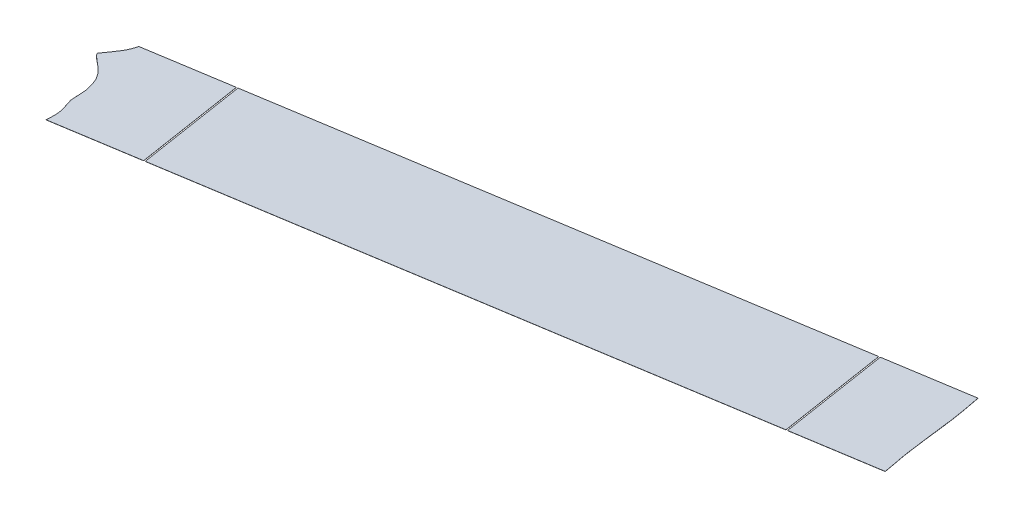
ISO-10303-21;
HEADER;
FILE_DESCRIPTION(('STEP AP214'),'2;1');
FILE_NAME('part.step','',(''),(''),'','','');
FILE_SCHEMA(('AUTOMOTIVE_DESIGN { 1 0 10303 214 1 1 1 1 }'));
ENDSEC;
DATA;
#1=APPLICATION_CONTEXT('core data for automotive mechanical design processes');
#2=APPLICATION_PROTOCOL_DEFINITION('international standard','automotive_design',2000,#1);
#3=PRODUCT_CONTEXT('',#1,'mechanical');
#4=PRODUCT('Part','Part','',(#3));
#5=PRODUCT_RELATED_PRODUCT_CATEGORY('part','',(#4));
#6=PRODUCT_DEFINITION_FORMATION('','',#4);
#7=PRODUCT_DEFINITION_CONTEXT('part definition',#1,'design');
#8=PRODUCT_DEFINITION('design','',#6,#7);
#9=PRODUCT_DEFINITION_SHAPE('','',#8);
#10=(LENGTH_UNIT() NAMED_UNIT(*) SI_UNIT(.MILLI.,.METRE.));
#11=(NAMED_UNIT(*) PLANE_ANGLE_UNIT() SI_UNIT($,.RADIAN.));
#12=(NAMED_UNIT(*) SI_UNIT($,.STERADIAN.) SOLID_ANGLE_UNIT());
#13=UNCERTAINTY_MEASURE_WITH_UNIT(LENGTH_MEASURE(1.E-05),#10,'distance_accuracy_value','');
#14=(GEOMETRIC_REPRESENTATION_CONTEXT(3) GLOBAL_UNCERTAINTY_ASSIGNED_CONTEXT((#13)) GLOBAL_UNIT_ASSIGNED_CONTEXT((#10,
#11,#12)) REPRESENTATION_CONTEXT('',''));
#15=CARTESIAN_POINT('',(0.,0.,0.));
#16=DIRECTION('',(0.,0.,1.));
#17=DIRECTION('',(1.,0.,0.));
#18=AXIS2_PLACEMENT_3D('',#15,#16,#17);
#19=CARTESIAN_POINT('',(2071.33887699728,381.384892477977,167.6098036128));
#20=DIRECTION('',(0.156902088768091,0.00396825396825129,0.987606190493282));
#21=DIRECTION('',(0.987613966521994,0.,-0.15690332415438));
#22=AXIS2_PLACEMENT_3D('',#19,#20,#21);
#23=PLANE('',#22);
#24=DIRECTION('',(-0.987613966521994,0.,0.15690332415438));
#25=VECTOR('',#24,1.);
#26=CARTESIAN_POINT('',(2071.33887699728,381.384892477977,167.6098036128));
#27=LINE('',#26,#25);
#28=CARTESIAN_POINT('',(2010.41756707299,381.384892477977,177.28843956063));
#29=VERTEX_POINT('',#28);
#30=CARTESIAN_POINT('',(1617.34720839724,381.384892477977,239.735962574076));
#31=VERTEX_POINT('',#30);
#32=EDGE_CURVE('E126',#29,#31,#27,.T.);
#33=ORIENTED_EDGE('',*,*,#32,.F.);
#34=DIRECTION('',(-0.00062263223863611,0.999992126449227,-0.00391910304130234));
#35=VECTOR('',#34,1.);
#36=CARTESIAN_POINT('',(2010.42379339538,371.384971213485,177.327630591043));
#37=LINE('',#36,#35);
#38=CARTESIAN_POINT('',(2010.41762933622,381.284893265332,177.288831470933));
#39=VERTEX_POINT('',#38);
#40=EDGE_CURVE('E67',#39,#29,#37,.T.);
#41=ORIENTED_EDGE('',*,*,#40,.F.);
#42=DIRECTION('',(-0.987613966521994,0.,0.15690332415438));
#43=VECTOR('',#42,1.);
#44=CARTESIAN_POINT('',(2071.33893926051,381.284893265333,167.610195523104));
#45=LINE('',#44,#43);
#46=CARTESIAN_POINT('',(1617.34727066046,381.284893265332,239.736354484378));
#47=VERTEX_POINT('',#46);
#48=EDGE_CURVE('E61',#39,#47,#45,.T.);
#49=ORIENTED_EDGE('',*,*,#48,.T.);
#50=DIRECTION('',(-0.00062263223863611,0.999992126449227,-0.00391910304130234));
#51=VECTOR('',#50,1.);
#52=CARTESIAN_POINT('',(1617.35343471963,371.384971213485,239.775153604489));
#53=LINE('',#52,#51);
#54=EDGE_CURVE('E109',#47,#31,#53,.T.);
#55=ORIENTED_EDGE('',*,*,#54,.T.);
#56=EDGE_LOOP('',(#33,#41,#49,#55));
#57=FACE_BOUND('',#56,.T.);
#58=ADVANCED_FACE('F58',(#57),#23,.F.);
#59=CARTESIAN_POINT('',(2083.79012268682,381.699900005905,246.008482464677));
#60=DIRECTION('',(0.156902088768096,0.00396825396825129,0.987606190493282));
#61=DIRECTION('',(0.987613966521993,0.,-0.156903324154385));
#62=AXIS2_PLACEMENT_3D('',#59,#60,#61);
#63=PLANE('',#62);
#64=DIRECTION('',(-0.00062263223863611,0.999992126449227,-0.00391910304130234));
#65=VECTOR('',#64,1.);
#66=CARTESIAN_POINT('',(2022.87897885242,371.699978741413,255.725683527698));
#67=LINE('',#66,#65);
#68=CARTESIAN_POINT('',(2022.87281479326,381.59990079326,255.686884407589));
#69=VERTEX_POINT('',#68);
#70=CARTESIAN_POINT('',(2022.87275253003,381.699900005905,255.686492497285));
#71=VERTEX_POINT('',#70);
#72=EDGE_CURVE('E116',#69,#71,#67,.T.);
#73=ORIENTED_EDGE('',*,*,#72,.T.);
#74=DIRECTION('',(-0.987613966521993,0.,0.156903324154385));
#75=VECTOR('',#74,1.);
#76=CARTESIAN_POINT('',(2083.79012268682,381.699900005905,246.008482464677));
#77=LINE('',#76,#75);
#78=CARTESIAN_POINT('',(1629.80239385428,381.699900005905,318.134015510731));
#79=VERTEX_POINT('',#78);
#80=EDGE_CURVE('E101',#71,#79,#77,.T.);
#81=ORIENTED_EDGE('',*,*,#80,.T.);
#82=DIRECTION('',(-0.00062263223863611,0.999992126449227,-0.00391910304130234));
#83=VECTOR('',#82,1.);
#84=CARTESIAN_POINT('',(1629.80862017666,371.699978741413,318.173206541144));
#85=LINE('',#84,#83);
#86=CARTESIAN_POINT('',(1629.8024561175,381.59990079326,318.134407421035));
#87=VERTEX_POINT('',#86);
#88=EDGE_CURVE('E119',#87,#79,#85,.T.);
#89=ORIENTED_EDGE('',*,*,#88,.F.);
#90=DIRECTION('',(-0.987613966521993,0.,0.156903324154385));
#91=VECTOR('',#90,1.);
#92=CARTESIAN_POINT('',(2083.79018495004,381.59990079326,246.008874374982));
#93=LINE('',#92,#91);
#94=EDGE_CURVE('E90',#69,#87,#93,.T.);
#95=ORIENTED_EDGE('',*,*,#94,.F.);
#96=EDGE_LOOP('',(#73,#81,#89,#95));
#97=FACE_BOUND('',#96,.T.);
#98=ADVANCED_FACE('F130',(#97),#63,.T.);
#99=CARTESIAN_POINT('',(-2946.66746904006,403.192390755681,6529.19275696574));
#100=DIRECTION('',(-0.00062263223863611,0.999992126449227,-0.00391910304130233));
#101=DIRECTION('',(0.,0.00391910380096367,0.99999232028321));
#102=AXIS2_PLACEMENT_3D('',#99,#100,#101);
#103=PLANE('',#102);
#104=DIRECTION('',(0.156902088768101,0.00396825396779671,0.987606190493283));
#105=VECTOR('',#104,1.);
#106=CARTESIAN_POINT('',(2022.87275253003,381.699900005905,255.686492497285));
#107=LINE('',#106,#105);
#108=EDGE_CURVE('E14',#29,#71,#107,.T.);
#109=ORIENTED_EDGE('',*,*,#108,.F.);
#110=ORIENTED_EDGE('',*,*,#32,.T.);
#111=DIRECTION('',(-0.156902088768099,-0.00396825396779671,-0.987606190493283));
#112=VECTOR('',#111,1.);
#113=CARTESIAN_POINT('',(1629.80239385428,381.699900005905,318.134015510731));
#114=LINE('',#113,#112);
#115=EDGE_CURVE('E115',#79,#31,#114,.T.);
#116=ORIENTED_EDGE('',*,*,#115,.F.);
#117=ORIENTED_EDGE('',*,*,#80,.F.);
#118=EDGE_LOOP('',(#109,#110,#116,#117));
#119=FACE_BOUND('',#118,.T.);
#120=ADVANCED_FACE('F131',(#119),#103,.T.);
#121=CARTESIAN_POINT('',(-2946.66740677683,403.092391543036,6529.19314887605));
#122=DIRECTION('',(-0.00062263223863611,0.999992126449227,-0.00391910304130233));
#123=DIRECTION('',(0.,0.00391910380096367,0.99999232028321));
#124=AXIS2_PLACEMENT_3D('',#121,#122,#123);
#125=PLANE('',#124);
#126=ORIENTED_EDGE('',*,*,#48,.F.);
#127=DIRECTION('',(0.156902088768102,0.0039682539677967,0.987606190493283));
#128=VECTOR('',#127,1.);
#129=CARTESIAN_POINT('',(2872.67142114136,403.092391543036,5604.66834725079));
#130=LINE('',#129,#128);
#131=EDGE_CURVE('E76',#39,#69,#130,.T.);
#132=ORIENTED_EDGE('',*,*,#131,.T.);
#133=ORIENTED_EDGE('',*,*,#94,.T.);
#134=DIRECTION('',(-0.156902088768099,-0.0039682539677967,-0.987606190493283));
#135=VECTOR('',#134,1.);
#136=CARTESIAN_POINT('',(2479.6010624656,403.092391543036,5667.11587026425));
#137=LINE('',#136,#135);
#138=EDGE_CURVE('E113',#87,#47,#137,.T.);
#139=ORIENTED_EDGE('',*,*,#138,.T.);
#140=EDGE_LOOP('',(#126,#132,#133,#139));
#141=FACE_BOUND('',#140,.T.);
#142=ADVANCED_FACE('F118',(#141),#125,.F.);
#143=CARTESIAN_POINT('',(1629.80862017666,371.699978741413,318.173206541144));
#144=DIRECTION('',(0.987613966521992,0.,-0.156903324154388));
#145=DIRECTION('',(-0.156903324154388,0.,-0.987613966521993));
#146=AXIS2_PLACEMENT_3D('',#143,#144,#145);
#147=PLANE('',#146);
#148=ORIENTED_EDGE('',*,*,#88,.T.);
#149=ORIENTED_EDGE('',*,*,#115,.T.);
#150=ORIENTED_EDGE('',*,*,#54,.F.);
#151=ORIENTED_EDGE('',*,*,#138,.F.);
#152=EDGE_LOOP('',(#148,#149,#150,#151));
#153=FACE_BOUND('',#152,.T.);
#154=ADVANCED_FACE('F112',(#153),#147,.F.);
#155=CARTESIAN_POINT('',(2022.87897885242,371.699978741413,255.725683527698));
#156=DIRECTION('',(-0.987613966521992,0.,0.156903324154391));
#157=DIRECTION('',(0.156903324154391,0.,0.987613966521992));
#158=AXIS2_PLACEMENT_3D('',#155,#156,#157);
#159=PLANE('',#158);
#160=ORIENTED_EDGE('',*,*,#40,.T.);
#161=ORIENTED_EDGE('',*,*,#108,.T.);
#162=ORIENTED_EDGE('',*,*,#72,.F.);
#163=ORIENTED_EDGE('',*,*,#131,.F.);
#164=EDGE_LOOP('',(#160,#161,#162,#163));
#165=FACE_BOUND('',#164,.T.);
#166=ADVANCED_FACE('F132',(#165),#159,.F.);
#167=CLOSED_SHELL('',(#58,#98,#120,#142,#154,#166));
#168=MANIFOLD_SOLID_BREP('B2',#167);
#169=CARTESIAN_POINT('',(2083.79012268682,381.699900005905,246.008482464679));
#170=CARTESIAN_POINT('',(2083.63100076041,381.696680753274,245.212342937488));
#171=CARTESIAN_POINT('',(2083.54692476346,381.694978013281,244.791231743634));
#172=CARTESIAN_POINT('',(2083.41236880606,381.692252933373,244.11728172317));
#173=CARTESIAN_POINT('',(2083.30421248932,381.690056020657,243.573903866964));
#174=CARTESIAN_POINT('',(2083.1752804441,381.687437103351,242.926148650787));
#175=CARTESIAN_POINT('',(2082.93644158216,381.682562055866,241.720183848063));
#176=CARTESIAN_POINT('',(2082.56804025949,381.674991496594,239.84702025756));
#177=CARTESIAN_POINT('',(2082.34729856242,381.670368050162,238.702378464453));
#178=CARTESIAN_POINT('',(2082.10300687589,381.665251347963,237.435619724111));
#179=CARTESIAN_POINT('',(2081.64810916562,381.655470930142,235.012333902094));
#180=CARTESIAN_POINT('',(2081.20708545204,381.645672781908,232.582319838726));
#181=CARTESIAN_POINT('',(2080.78243656861,381.635865883334,230.147471565162));
#182=CARTESIAN_POINT('',(2080.37579722953,381.626054804134,227.708695373436));
#183=CARTESIAN_POINT('',(2079.98801692212,381.616242486124,225.266606933729));
#184=CARTESIAN_POINT('',(2079.61918813814,381.606431457991,222.821836767649));
#185=CARTESIAN_POINT('',(2079.26868009701,381.596624685287,220.375241773165));
#186=CARTESIAN_POINT('',(2078.93520696045,381.586826780715,217.928203203138));
#187=CARTESIAN_POINT('',(2078.61697031648,381.577046878952,215.48333756265));
#188=CARTESIAN_POINT('',(2078.45668965038,381.571928197684,214.202726922303));
#189=CARTESIAN_POINT('',(2078.31201809104,381.567308004751,213.04682994006));
#190=CARTESIAN_POINT('',(2078.08181921326,381.559735983575,211.151336956759));
#191=CARTESIAN_POINT('',(2077.93523991659,381.554862210029,209.931039831124));
#192=CARTESIAN_POINT('',(2077.85700021854,381.552240227189,209.274448868812));
#193=CARTESIAN_POINT('',(2077.79167157867,381.550050922053,208.726208070414));
#194=CARTESIAN_POINT('',(2077.71051662001,381.547318234565,208.041833035924));
#195=CARTESIAN_POINT('',(2077.66178017357,381.545677158288,207.630841424769));
#196=CARTESIAN_POINT('',(2077.46722720374,381.539115585059,205.987509634997));
#197=CARTESIAN_POINT('',(2077.41848306409,381.537474249317,205.576453041544));
#198=CARTESIAN_POINT('',(2077.33733941831,381.53474194207,204.892173231685));
#199=CARTESIAN_POINT('',(2077.27199946555,381.532552256693,204.343837208654));
#200=CARTESIAN_POINT('',(2077.19377147413,381.529930664824,203.687344145871));
#201=CARTESIAN_POINT('',(2077.04719228637,381.525056891246,202.467046994773));
#202=CARTESIAN_POINT('',(2076.81699367081,381.517484871326,200.571554290554));
#203=CARTESIAN_POINT('',(2076.67231003371,381.512864286198,199.415559155166));
#204=CARTESIAN_POINT('',(2076.51204195025,381.507745999584,198.135047215058));
#205=CARTESIAN_POINT('',(2076.19380584808,381.497966097976,195.690181528328));
#206=CARTESIAN_POINT('',(2075.86033352064,381.488168198367,193.243144095872));
#207=CARTESIAN_POINT('',(2075.50982607054,381.478361422064,190.796548089197));
#208=CARTESIAN_POINT('',(2075.14099806021,381.468550394756,188.351778010634));
#209=CARTESIAN_POINT('',(2074.9451502618,381.463594689893,187.118402761275));
#210=CARTESIAN_POINT('',(2074.74943635516,381.458644834115,185.886498683729));
#211=CARTESIAN_POINT('',(2074.34314499168,381.448846119932,183.450822246676));
#212=CARTESIAN_POINT('',(2073.91889906168,381.439051592534,181.019066565374));
#213=CARTESIAN_POINT('',(2073.47833253701,381.429265810451,178.592135195488));
#214=CARTESIAN_POINT('',(2073.0239417836,381.419497743306,176.171920211721));
#215=CARTESIAN_POINT('',(2072.7799153439,381.414387032104,174.906647984319));
#216=CARTESIAN_POINT('',(2072.5594561504,381.409769896062,173.763571458903));
#217=CARTESIAN_POINT('',(2072.19150473933,381.40220887205,171.892769392025));
#218=CARTESIAN_POINT('',(2071.95296333888,381.397340001385,170.688333399093));
#219=CARTESIAN_POINT('',(2071.82417341825,381.394723996019,170.041298609471));
#220=CARTESIAN_POINT('',(2071.71617161742,381.392530242898,169.498702402193));
#221=CARTESIAN_POINT('',(2071.58176712438,381.389808236998,168.825512677576));
#222=CARTESIAN_POINT('',(2071.49780240828,381.388107754764,168.404959890719));
#223=CARTESIAN_POINT('',(2071.33887699728,381.384892477977,167.609803612801));
#224=B_SPLINE_CURVE_WITH_KNOTS('',2,(#169,#170,#171,#172,#173,#174,#175,#176,#177,#178,#179,
#180,#181,#182,#183,#184,#185,#186,#187,#188,#189,#190,#191,#192,#193,#194,#195,#196,#197,#198,
#199,#200,#201,#202,#203,#204,#205,#206,#207,#208,#209,#210,#211,#212,#213,#214,#215,#216,#217,
#218,#219,#220,#221,#222,#223),.UNSPECIFIED.,.F.,.F.,(3,2,2,1,1,2,1,1,1,1,1,1,1,1,1,2,1,1,2,2,1,
2,2,1,1,2,1,1,1,1,1,1,1,1,1,1,2,1,1,2,2,3),(0.,0.015625,0.03125,0.046875,0.0625,0.09375,0.125,
0.15625,0.1875,0.21875,0.25,0.28125,0.3125,0.34375,0.375,0.40625,0.4375,0.453125,0.46875,
0.484375,0.5,0.515625,0.53125,0.546875,0.5625,0.59375,0.625,0.65625,0.6875,0.71875,0.75,
0.750316619873047,0.781527042388916,0.812737464904785,0.843947887420654,0.875158309936523,
0.906368732452393,0.937579154968262,0.953184366226196,0.968789577484131,0.984394788742065,1.),.UNSPECIFIED.);
#225=DIRECTION('',(0.000622632238707982,-0.999992126449225,0.00391910304175121));
#226=VECTOR('',#225,1.);
#227=SURFACE_OF_LINEAR_EXTRUSION('',#224,#226);
#228=CARTESIAN_POINT('',(2083.79018495004,381.59990079326,246.008874374983));
#229=CARTESIAN_POINT('',(2083.63106302364,381.596681540629,245.212734847793));
#230=CARTESIAN_POINT('',(2083.54698702669,381.594978800636,244.791623653938));
#231=CARTESIAN_POINT('',(2083.41243106928,381.592253720728,244.117673633474));
#232=CARTESIAN_POINT('',(2083.30427475254,381.590056808012,243.574295777268));
#233=CARTESIAN_POINT('',(2083.17534270732,381.587437890706,242.926540561091));
#234=CARTESIAN_POINT('',(2082.93650384539,381.582562843221,241.720575758368));
#235=CARTESIAN_POINT('',(2082.56810252271,381.574992283949,239.847412167864));
#236=CARTESIAN_POINT('',(2082.34736082565,381.570368837517,238.702770374757));
#237=CARTESIAN_POINT('',(2082.10306913912,381.565252135318,237.436011634415));
#238=CARTESIAN_POINT('',(2081.64817142884,381.555471717497,235.012725812398));
#239=CARTESIAN_POINT('',(2081.20714771527,381.545673569263,232.58271174903));
#240=CARTESIAN_POINT('',(2080.78249883183,381.535866670689,230.147863475466));
#241=CARTESIAN_POINT('',(2080.37585949275,381.526055591489,227.70908728374));
#242=CARTESIAN_POINT('',(2079.98807918535,381.516243273479,225.266998844033));
#243=CARTESIAN_POINT('',(2079.61925040136,381.506432245346,222.822228677953));
#244=CARTESIAN_POINT('',(2079.26874236023,381.496625472642,220.37563368347));
#245=CARTESIAN_POINT('',(2078.93526922368,381.486827568071,217.928595113443));
#246=CARTESIAN_POINT('',(2078.61703257971,381.477047666307,215.483729472954));
#247=CARTESIAN_POINT('',(2078.45675191361,381.471928985039,214.203118832607));
#248=CARTESIAN_POINT('',(2078.31208035426,381.467308792107,213.047221850364));
#249=CARTESIAN_POINT('',(2078.08188147649,381.45973677093,211.151728867063));
#250=CARTESIAN_POINT('',(2077.93530217981,381.454862997384,209.931431741428));
#251=CARTESIAN_POINT('',(2077.85706248177,381.452241014544,209.274840779117));
#252=CARTESIAN_POINT('',(2077.79173384189,381.450051709409,208.726599980719));
#253=CARTESIAN_POINT('',(2077.71057888323,381.44731902192,208.042224946229));
#254=CARTESIAN_POINT('',(2077.66184243679,381.445677945643,207.631233335073));
#255=CARTESIAN_POINT('',(2077.46728946696,381.439116372414,205.987901545302));
#256=CARTESIAN_POINT('',(2077.41854532731,381.437475036672,205.576844951848));
#257=CARTESIAN_POINT('',(2077.33740168154,381.434742729425,204.89256514199));
#258=CARTESIAN_POINT('',(2077.27206172878,381.432553044048,204.344229118958));
#259=CARTESIAN_POINT('',(2077.19383373735,381.429931452179,203.687736056175));
#260=CARTESIAN_POINT('',(2077.04725454959,381.425057678601,202.467438905077));
#261=CARTESIAN_POINT('',(2076.81705593404,381.417485658681,200.571946200858));
#262=CARTESIAN_POINT('',(2076.67237229694,381.412865073553,199.415951065471));
#263=CARTESIAN_POINT('',(2076.51210421347,381.407746786939,198.135439125362));
#264=CARTESIAN_POINT('',(2076.19386811131,381.397966885332,195.690573438633));
#265=CARTESIAN_POINT('',(2075.86039578386,381.388168985722,193.243536006176));
#266=CARTESIAN_POINT('',(2075.50988833377,381.378362209419,190.796939999501));
#267=CARTESIAN_POINT('',(2075.14106032343,381.368551182111,188.352169920939));
#268=CARTESIAN_POINT('',(2074.94521252502,381.363595477248,187.11879467158));
#269=CARTESIAN_POINT('',(2074.74949861839,381.358645621471,185.886890594034));
#270=CARTESIAN_POINT('',(2074.3432072549,381.348846907287,183.45121415698));
#271=CARTESIAN_POINT('',(2073.9189613249,381.339052379889,181.019458475678));
#272=CARTESIAN_POINT('',(2073.47839480024,381.329266597806,178.592527105793));
#273=CARTESIAN_POINT('',(2073.02400404682,381.319498530661,176.172312122026));
#274=CARTESIAN_POINT('',(2072.77997760712,381.314387819459,174.907039894624));
#275=CARTESIAN_POINT('',(2072.55951841363,381.309770683417,173.763963369207));
#276=CARTESIAN_POINT('',(2072.19156700256,381.302209659405,171.893161302329));
#277=CARTESIAN_POINT('',(2071.95302560211,381.29734078874,170.688725309397));
#278=CARTESIAN_POINT('',(2071.82423568147,381.294724783375,170.041690519775));
#279=CARTESIAN_POINT('',(2071.71623388065,381.292531030253,169.499094312497));
#280=CARTESIAN_POINT('',(2071.58182938761,381.289809024353,168.82590458788));
#281=CARTESIAN_POINT('',(2071.4978646715,381.288108542119,168.405351801023));
#282=CARTESIAN_POINT('',(2071.33893926051,381.284893265332,167.610195523105));
#283=B_SPLINE_CURVE_WITH_KNOTS('',2,(#228,#229,#230,#231,#232,#233,#234,#235,#236,#237,#238,
#239,#240,#241,#242,#243,#244,#245,#246,#247,#248,#249,#250,#251,#252,#253,#254,#255,#256,#257,
#258,#259,#260,#261,#262,#263,#264,#265,#266,#267,#268,#269,#270,#271,#272,#273,#274,#275,#276,
#277,#278,#279,#280,#281,#282),.UNSPECIFIED.,.F.,.F.,(3,2,2,1,1,2,1,1,1,1,1,1,1,1,1,2,1,1,2,2,1,
2,2,1,1,2,1,1,1,1,1,1,1,1,1,1,2,1,1,2,2,3),(0.,0.015625,0.03125,0.046875,0.0625,0.09375,0.125,
0.15625,0.1875,0.21875,0.25,0.28125,0.3125,0.34375,0.375,0.40625,0.4375,0.453125,0.46875,
0.484375,0.5,0.515625,0.53125,0.546875,0.5625,0.59375,0.625,0.65625,0.6875,0.71875,0.75,
0.750316619873047,0.781527042388916,0.812737464904785,0.843947887420654,0.875158309936523,
0.906368732452393,0.937579154968262,0.953184366226196,0.968789577484131,0.984394788742065,1.),.UNSPECIFIED.);
#284=CARTESIAN_POINT('',(2083.79018495004,381.59990079326,246.008874374982));
#285=VERTEX_POINT('',#284);
#286=CARTESIAN_POINT('',(2071.33893926051,381.284893265332,167.610195523105));
#287=VERTEX_POINT('',#286);
#288=EDGE_CURVE('E262',#285,#287,#283,.T.);
#289=ORIENTED_EDGE('',*,*,#288,.T.);
#290=DIRECTION('',(0.000622632238707982,-0.999992126449225,0.00391910304175121));
#291=VECTOR('',#290,1.);
#292=CARTESIAN_POINT('',(2071.33887699728,381.384892477977,167.609803612801));
#293=LINE('',#292,#291);
#294=CARTESIAN_POINT('',(2071.33887699728,381.384892477977,167.609803612801));
#295=VERTEX_POINT('',#294);
#296=EDGE_CURVE('E250',#295,#287,#293,.T.);
#297=ORIENTED_EDGE('',*,*,#296,.F.);
#298=CARTESIAN_POINT('',(2083.79012268682,381.699900005905,246.008482464677));
#299=VERTEX_POINT('',#298);
#300=EDGE_CURVE('E249',#299,#295,#224,.T.);
#301=ORIENTED_EDGE('',*,*,#300,.F.);
#302=DIRECTION('',(0.000622632238707982,-0.999992126449225,0.00391910304175121));
#303=VECTOR('',#302,1.);
#304=CARTESIAN_POINT('',(2083.79012268682,381.699900005905,246.008482464677));
#305=LINE('',#304,#303);
#306=EDGE_CURVE('E199',#299,#285,#305,.T.);
#307=ORIENTED_EDGE('',*,*,#306,.T.);
#308=EDGE_LOOP('',(#289,#297,#301,#307));
#309=FACE_BOUND('',#308,.T.);
#310=ADVANCED_FACE('F191',(#309),#227,.F.);
#311=CARTESIAN_POINT('',(-2946.66746904006,403.192390755681,6529.19275696574));
#312=DIRECTION('',(-0.00062263223863611,0.999992126449227,-0.00391910304130233));
#313=DIRECTION('',(0.,0.00391910380096367,0.99999232028321));
#314=AXIS2_PLACEMENT_3D('',#311,#312,#313);
#315=PLANE('',#314);
#316=DIRECTION('',(-0.156902088768096,-0.00396825396779671,-0.987606190493283));
#317=VECTOR('',#316,1.);
#318=CARTESIAN_POINT('',(2011.40518103951,381.384892477977,177.131536236475));
#319=LINE('',#318,#317);
#320=CARTESIAN_POINT('',(2023.86036649655,381.699900005905,255.52958917313));
#321=VERTEX_POINT('',#320);
#322=CARTESIAN_POINT('',(2011.40518103951,381.384892477977,177.131536236475));
#323=VERTEX_POINT('',#322);
#324=EDGE_CURVE('E234',#321,#323,#319,.T.);
#325=ORIENTED_EDGE('',*,*,#324,.F.);
#326=DIRECTION('',(-0.987613966521993,0.,0.156903324154385));
#327=VECTOR('',#326,1.);
#328=CARTESIAN_POINT('',(2083.79012268682,381.699900005905,246.008482464677));
#329=LINE('',#328,#327);
#330=EDGE_CURVE('E246',#299,#321,#329,.T.);
#331=ORIENTED_EDGE('',*,*,#330,.F.);
#332=ORIENTED_EDGE('',*,*,#300,.T.);
#333=DIRECTION('',(-0.987613966521994,0.,0.15690332415438));
#334=VECTOR('',#333,1.);
#335=CARTESIAN_POINT('',(2071.33887699728,381.384892477977,167.6098036128));
#336=LINE('',#335,#334);
#337=EDGE_CURVE('E227',#295,#323,#336,.T.);
#338=ORIENTED_EDGE('',*,*,#337,.T.);
#339=EDGE_LOOP('',(#325,#331,#332,#338));
#340=FACE_BOUND('',#339,.T.);
#341=ADVANCED_FACE('F245',(#340),#315,.T.);
#342=CARTESIAN_POINT('',(-2946.66740677683,403.092391543036,6529.19314887605));
#343=DIRECTION('',(-0.00062263223863611,0.999992126449227,-0.00391910304130233));
#344=DIRECTION('',(0.,0.00391910380096367,0.99999232028321));
#345=AXIS2_PLACEMENT_3D('',#342,#343,#344);
#346=PLANE('',#345);
#347=DIRECTION('',(-0.987613966521993,0.,0.156903324154385));
#348=VECTOR('',#347,1.);
#349=CARTESIAN_POINT('',(2083.79018495004,381.59990079326,246.008874374982));
#350=LINE('',#349,#348);
#351=CARTESIAN_POINT('',(2023.86042875978,381.59990079326,255.529981083434));
#352=VERTEX_POINT('',#351);
#353=EDGE_CURVE('E261',#285,#352,#350,.T.);
#354=ORIENTED_EDGE('',*,*,#353,.T.);
#355=DIRECTION('',(-0.156902088768096,-0.0039682539677967,-0.987606190493283));
#356=VECTOR('',#355,1.);
#357=CARTESIAN_POINT('',(2873.65903510786,403.092391543036,5604.51144392667));
#358=LINE('',#357,#356);
#359=CARTESIAN_POINT('',(2011.40524330274,381.284893265332,177.131928146781));
#360=VERTEX_POINT('',#359);
#361=EDGE_CURVE('E56',#352,#360,#358,.T.);
#362=ORIENTED_EDGE('',*,*,#361,.T.);
#363=DIRECTION('',(-0.987613966521994,0.,0.15690332415438));
#364=VECTOR('',#363,1.);
#365=CARTESIAN_POINT('',(2071.33893926051,381.284893265333,167.610195523104));
#366=LINE('',#365,#364);
#367=EDGE_CURVE('E253',#287,#360,#366,.T.);
#368=ORIENTED_EDGE('',*,*,#367,.F.);
#369=ORIENTED_EDGE('',*,*,#288,.F.);
#370=EDGE_LOOP('',(#354,#362,#368,#369));
#371=FACE_BOUND('',#370,.T.);
#372=ADVANCED_FACE('F273',(#371),#346,.F.);
#373=CARTESIAN_POINT('',(2083.79012268682,381.699900005905,246.008482464677));
#374=DIRECTION('',(0.156902088768096,0.00396825396825129,0.987606190493282));
#375=DIRECTION('',(0.987613966521993,0.,-0.156903324154385));
#376=AXIS2_PLACEMENT_3D('',#373,#374,#375);
#377=PLANE('',#376);
#378=DIRECTION('',(-0.00062263223863611,0.999992126449227,-0.00391910304130234));
#379=VECTOR('',#378,1.);
#380=CARTESIAN_POINT('',(2023.86659281894,371.699978741413,255.568780203543));
#381=LINE('',#380,#379);
#382=EDGE_CURVE('E236',#352,#321,#381,.T.);
#383=ORIENTED_EDGE('',*,*,#382,.F.);
#384=ORIENTED_EDGE('',*,*,#353,.F.);
#385=ORIENTED_EDGE('',*,*,#306,.F.);
#386=ORIENTED_EDGE('',*,*,#330,.T.);
#387=EDGE_LOOP('',(#383,#384,#385,#386));
#388=FACE_BOUND('',#387,.T.);
#389=ADVANCED_FACE('F248',(#388),#377,.T.);
#390=CARTESIAN_POINT('',(2071.33887699728,381.384892477977,167.6098036128));
#391=DIRECTION('',(0.156902088768091,0.00396825396825129,0.987606190493282));
#392=DIRECTION('',(0.987613966521994,0.,-0.15690332415438));
#393=AXIS2_PLACEMENT_3D('',#390,#391,#392);
#394=PLANE('',#393);
#395=ORIENTED_EDGE('',*,*,#367,.T.);
#396=DIRECTION('',(-0.00062263223863611,0.999992126449227,-0.00391910304130234));
#397=VECTOR('',#396,1.);
#398=CARTESIAN_POINT('',(2011.4114073619,371.384971213485,177.170727266888));
#399=LINE('',#398,#397);
#400=EDGE_CURVE('E206',#360,#323,#399,.T.);
#401=ORIENTED_EDGE('',*,*,#400,.T.);
#402=ORIENTED_EDGE('',*,*,#337,.F.);
#403=ORIENTED_EDGE('',*,*,#296,.T.);
#404=EDGE_LOOP('',(#395,#401,#402,#403));
#405=FACE_BOUND('',#404,.T.);
#406=ADVANCED_FACE('F193',(#405),#394,.F.);
#407=CARTESIAN_POINT('',(2011.4114073619,371.384971213485,177.170727266888));
#408=DIRECTION('',(0.987613966521993,0.,-0.156903324154385));
#409=DIRECTION('',(-0.156903324154385,0.,-0.987613966521993));
#410=AXIS2_PLACEMENT_3D('',#407,#408,#409);
#411=PLANE('',#410);
#412=ORIENTED_EDGE('',*,*,#382,.T.);
#413=ORIENTED_EDGE('',*,*,#324,.T.);
#414=ORIENTED_EDGE('',*,*,#400,.F.);
#415=ORIENTED_EDGE('',*,*,#361,.F.);
#416=EDGE_LOOP('',(#412,#413,#414,#415));
#417=FACE_BOUND('',#416,.T.);
#418=ADVANCED_FACE('F237',(#417),#411,.F.);
#419=CLOSED_SHELL('',(#310,#341,#372,#389,#406,#418));
#420=MANIFOLD_SOLID_BREP('B8',#419);
#421=CARTESIAN_POINT('',(1556.42589847295,381.384892477977,249.414598521908));
#422=CARTESIAN_POINT('',(1556.19009339261,381.389920822655,250.735085602036));
#423=CARTESIAN_POINT('',(1555.37852415196,381.39935647511,253.271606645599));
#424=CARTESIAN_POINT('',(1554.80554035613,381.404110913768,254.575772255407));
#425=CARTESIAN_POINT('',(1554.75004560312,381.40456442998,254.700307246603));
#426=CARTESIAN_POINT('',(1554.23889534797,381.40868682257,255.83337741925));
#427=CARTESIAN_POINT('',(1553.59221942049,381.412929501415,257.018670755946));
#428=CARTESIAN_POINT('',(1553.52836703284,381.413344479694,257.134700256103));
#429=CARTESIAN_POINT('',(1552.92754953274,381.41721455027,258.217633877648));
#430=CARTESIAN_POINT('',(1552.19779519358,381.421298749177,259.375688483444));
#431=CARTESIAN_POINT('',(1552.12743284589,381.421689999827,259.486697923854));
#432=CARTESIAN_POINT('',(1551.48086588967,381.425264127463,260.501387480279));
#433=CARTESIAN_POINT('',(1550.69560963485,381.429229361001,261.637904721713));
#434=CARTESIAN_POINT('',(1550.29424427014,381.431247878078,262.216711702689));
#435=CARTESIAN_POINT('',(1549.87393051437,381.43329563274,262.805989251447));
#436=CARTESIAN_POINT('',(1549.53134325519,381.434964706491,263.286294684131));
#437=CARTESIAN_POINT('',(1549.07661173354,381.437140123997,263.913614470652));
#438=CARTESIAN_POINT('',(1548.92548724434,381.437863097541,264.12209657007));
#439=CARTESIAN_POINT('',(1548.37735779305,381.44047732689,264.876221124102));
#440=CARTESIAN_POINT('',(1548.27071025711,381.440986954572,265.023200128556));
#441=CARTESIAN_POINT('',(1547.78084917193,381.443327812868,265.698314597782));
#442=CARTESIAN_POINT('',(1547.47033067203,381.444847511786,266.13541098511));
#443=CARTESIAN_POINT('',(1547.01585748609,381.447071734848,266.775142877977));
#444=CARTESIAN_POINT('',(1546.68936085489,381.448780903208,267.263122451655));
#445=CARTESIAN_POINT('',(1546.25633282416,381.451047749902,267.910323107444));
#446=CARTESIAN_POINT('',(1545.96115399535,381.452862233206,268.420199181511));
#447=B_SPLINE_CURVE_WITH_KNOTS('',2,(#421,#422,#423,#424,#425,#426,#427,#428,#429,#430,#431,
#432,#433,#434,#435,#436,#437,#438,#439,#440,#441,#442,#443,#444,#445,#446),.UNSPECIFIED.,.F.,
.F.,(3,1,1,1,1,1,1,1,1,1,1,1,1,2,2,1,2,2,2,3),(0.,0.125,0.24375,0.25,0.25625,0.3690625,0.375,
0.38125,0.4940625,0.5,0.50625,0.6190625,0.625,0.6875,0.75,0.78125,0.8125,0.875,0.9375,1.),.UNSPECIFIED.);
#448=DIRECTION('',(0.000622632238707982,-0.999992126449225,0.00391910304175121));
#449=VECTOR('',#448,1.);
#450=SURFACE_OF_LINEAR_EXTRUSION('',#447,#449);
#451=CARTESIAN_POINT('',(1556.42596073617,381.284893265332,249.414990432213));
#452=CARTESIAN_POINT('',(1556.19015565583,381.28992161001,250.73547751234));
#453=CARTESIAN_POINT('',(1555.37858641519,381.299357262465,253.271998555903));
#454=CARTESIAN_POINT('',(1554.80560261935,381.304111701123,254.576164165712));
#455=CARTESIAN_POINT('',(1554.75010786635,381.304565217335,254.700699156907));
#456=CARTESIAN_POINT('',(1554.2389576112,381.308687609925,255.833769329554));
#457=CARTESIAN_POINT('',(1553.59228168371,381.31293028877,257.01906266625));
#458=CARTESIAN_POINT('',(1553.52842929606,381.313345267049,257.135092166407));
#459=CARTESIAN_POINT('',(1552.92761179596,381.317215337625,258.218025787952));
#460=CARTESIAN_POINT('',(1552.1978574568,381.321299536532,259.376080393748));
#461=CARTESIAN_POINT('',(1552.12749510912,381.321690787182,259.487089834158));
#462=CARTESIAN_POINT('',(1551.48092815289,381.325264914818,260.501779390583));
#463=CARTESIAN_POINT('',(1550.69567189807,381.329230148356,261.638296632017));
#464=CARTESIAN_POINT('',(1550.29430653336,381.331248665433,262.217103612993));
#465=CARTESIAN_POINT('',(1549.8739927776,381.333296420095,262.806381161751));
#466=CARTESIAN_POINT('',(1549.53140551842,381.334965493846,263.286686594435));
#467=CARTESIAN_POINT('',(1549.07667399677,381.337140911352,263.914006380956));
#468=CARTESIAN_POINT('',(1548.92554950756,381.337863884896,264.122488480374));
#469=CARTESIAN_POINT('',(1548.37742005628,381.340478114245,264.876613034406));
#470=CARTESIAN_POINT('',(1548.27077252033,381.340987741927,265.02359203886));
#471=CARTESIAN_POINT('',(1547.78091143515,381.343328600223,265.698706508086));
#472=CARTESIAN_POINT('',(1547.47039293525,381.344848299141,266.135802895414));
#473=CARTESIAN_POINT('',(1547.01591974931,381.347072522203,266.775534788281));
#474=CARTESIAN_POINT('',(1546.68942311811,381.348781690563,267.263514361959));
#475=CARTESIAN_POINT('',(1546.25639508739,381.351048537257,267.910715017748));
#476=CARTESIAN_POINT('',(1545.96121625858,381.352863020562,268.420591091815));
#477=B_SPLINE_CURVE_WITH_KNOTS('',2,(#451,#452,#453,#454,#455,#456,#457,#458,#459,#460,#461,
#462,#463,#464,#465,#466,#467,#468,#469,#470,#471,#472,#473,#474,#475,#476),.UNSPECIFIED.,.F.,
.F.,(3,1,1,1,1,1,1,1,1,1,1,1,1,2,2,1,2,2,2,3),(0.,0.125,0.24375,0.25,0.25625,0.3690625,0.375,
0.38125,0.4940625,0.5,0.50625,0.6190625,0.625,0.6875,0.75,0.78125,0.8125,0.875,0.9375,1.),.UNSPECIFIED.);
#478=CARTESIAN_POINT('',(1556.42596073617,381.284893265332,249.414990432213));
#479=VERTEX_POINT('',#478);
#480=CARTESIAN_POINT('',(1545.96121653857,381.35286301884,268.420590608169));
#481=VERTEX_POINT('',#480);
#482=EDGE_CURVE('E479',#479,#481,#477,.T.);
#483=ORIENTED_EDGE('',*,*,#482,.T.);
#484=DIRECTION('',(0.000622632238707982,-0.999992126449225,0.00391910304175121));
#485=VECTOR('',#484,1.);
#486=CARTESIAN_POINT('',(1545.96115427535,381.452862231485,268.420198697865));
#487=LINE('',#486,#485);
#488=CARTESIAN_POINT('',(1545.96115427535,381.452862231485,268.420198697865));
#489=VERTEX_POINT('',#488);
#490=EDGE_CURVE('E517',#489,#481,#487,.T.);
#491=ORIENTED_EDGE('',*,*,#490,.F.);
#492=CARTESIAN_POINT('',(1556.42589847295,381.384892477977,249.414598521908));
#493=VERTEX_POINT('',#492);
#494=EDGE_CURVE('E451',#493,#489,#447,.T.);
#495=ORIENTED_EDGE('',*,*,#494,.F.);
#496=DIRECTION('',(0.000622632238707982,-0.999992126449225,0.00391910304175121));
#497=VECTOR('',#496,1.);
#498=CARTESIAN_POINT('',(1556.42589847295,381.384892477977,249.414598521908));
#499=LINE('',#498,#497);
#500=EDGE_CURVE('E334',#493,#479,#499,.T.);
#501=ORIENTED_EDGE('',*,*,#500,.T.);
#502=EDGE_LOOP('',(#483,#491,#495,#501));
#503=FACE_BOUND('',#502,.T.);
#504=ADVANCED_FACE('F326',(#503),#450,.F.);
#505=CARTESIAN_POINT('',(1545.96115399535,381.452862233206,268.42019918151));
#506=CARTESIAN_POINT('',(1546.04638038849,381.45366577287,268.611689078258));
#507=CARTESIAN_POINT('',(1546.26437467638,381.455306391937,268.995673847799));
#508=CARTESIAN_POINT('',(1546.62160944332,381.457582775689,269.519758038584));
#509=CARTESIAN_POINT('',(1547.31402867999,381.461170908684,270.325294961605));
#510=CARTESIAN_POINT('',(1548.01126941156,381.464224915358,270.993779061815));
#511=CARTESIAN_POINT('',(1548.72507311415,381.467247691385,271.651663022194));
#512=CARTESIAN_POINT('',(1549.5063988996,381.470315564681,272.310326622242));
#513=CARTESIAN_POINT('',(1550.03092587712,381.472375118247,272.752506867371));
#514=CARTESIAN_POINT('',(1550.85605100636,381.4755392982,273.428785471314));
#515=CARTESIAN_POINT('',(1551.1956302187,381.476841512493,273.707107082796));
#516=CARTESIAN_POINT('',(1551.92166529732,381.479630482021,274.303390134918));
#517=CARTESIAN_POINT('',(1552.21370391327,381.480759756377,274.545137493376));
#518=CARTESIAN_POINT('',(1552.96806499142,381.48367677,275.169591890864));
#519=CARTESIAN_POINT('',(1553.56513622069,381.48605167486,275.680711487406));
#520=CARTESIAN_POINT('',(1554.26982638971,381.488854643795,276.283957695256));
#521=CARTESIAN_POINT('',(1555.5556926691,381.494205697651,277.445037125071));
#522=CARTESIAN_POINT('',(1556.22202242505,381.497153568991,278.091350762536));
#523=CARTESIAN_POINT('',(1557.49306246394,381.502820013238,279.335260166009));
#524=CARTESIAN_POINT('',(1558.51428449982,381.508160809455,280.535766596913));
#525=CARTESIAN_POINT('',(1558.62416075349,381.508741052334,280.666364289055));
#526=CARTESIAN_POINT('',(1559.79957002425,381.515021900746,282.082237052708));
#527=CARTESIAN_POINT('',(1561.12189138001,381.524140989836,284.198970727876));
#528=CARTESIAN_POINT('',(1561.92405752607,381.530746927301,285.757090247939));
#529=CARTESIAN_POINT('',(1562.59002802175,381.537532232282,287.382614452902));
#530=CARTESIAN_POINT('',(1563.11350308352,381.544437467589,289.061378297418));
#531=CARTESIAN_POINT('',(1563.31280980007,381.548000770552,289.938920960604));
#532=B_SPLINE_CURVE_WITH_KNOTS('',2,(#505,#506,#507,#508,#509,#510,#511,#512,#513,#514,#515,
#516,#517,#518,#519,#520,#521,#522,#523,#524,#525,#526,#527,#528,#529,#530,#531),.UNSPECIFIED.,
.F.,.F.,(3,1,1,1,1,1,2,2,1,2,2,1,1,1,1,1,1,1,1,1,1,3),(0.,0.015625,0.03125,0.0625,
0.109209060668945,0.125,0.1875,0.25,0.28125,0.3125,0.375,0.4375,0.5,0.50625,0.6190625,0.625,
0.63125,0.75,0.8125,0.875,0.9375,1.),.UNSPECIFIED.);
#533=DIRECTION('',(0.000622632238707982,-0.999992126449225,0.00391910304175121));
#534=VECTOR('',#533,1.);
#535=SURFACE_OF_LINEAR_EXTRUSION('',#532,#534);
#536=CARTESIAN_POINT('',(1545.96121625857,381.352863020562,268.420591091815));
#537=CARTESIAN_POINT('',(1546.04644265172,381.353666560225,268.612080988562));
#538=CARTESIAN_POINT('',(1546.26443693961,381.355307179292,268.996065758103));
#539=CARTESIAN_POINT('',(1546.62167170655,381.357583563044,269.520149948888));
#540=CARTESIAN_POINT('',(1547.31409094321,381.361171696039,270.325686871909));
#541=CARTESIAN_POINT('',(1548.01133167479,381.364225702713,270.994170972119));
#542=CARTESIAN_POINT('',(1548.72513537738,381.36724847874,271.652054932499));
#543=CARTESIAN_POINT('',(1549.50646116282,381.370316352036,272.310718532546));
#544=CARTESIAN_POINT('',(1550.03098814034,381.372375905602,272.752898777675));
#545=CARTESIAN_POINT('',(1550.85611326959,381.375540085555,273.429177381618));
#546=CARTESIAN_POINT('',(1551.19569248193,381.376842299848,273.7074989931));
#547=CARTESIAN_POINT('',(1551.92172756055,381.379631269376,274.303782045222));
#548=CARTESIAN_POINT('',(1552.2137661765,381.380760543732,274.54552940368));
#549=CARTESIAN_POINT('',(1552.96812725465,381.383677557355,275.169983801168));
#550=CARTESIAN_POINT('',(1553.56519848392,381.386052462215,275.68110339771));
#551=CARTESIAN_POINT('',(1554.26988865293,381.38885543115,276.28434960556));
#552=CARTESIAN_POINT('',(1555.55575493233,381.394206485006,277.445429035375));
#553=CARTESIAN_POINT('',(1556.22208468827,381.397154356346,278.09174267284));
#554=CARTESIAN_POINT('',(1557.49312472716,381.402820800593,279.335652076313));
#555=CARTESIAN_POINT('',(1558.51434676304,381.40816159681,280.536158507217));
#556=CARTESIAN_POINT('',(1558.62422301671,381.408741839689,280.666756199359));
#557=CARTESIAN_POINT('',(1559.79963228748,381.415022688101,282.082628963012));
#558=CARTESIAN_POINT('',(1561.12195364323,381.424141777191,284.19936263818));
#559=CARTESIAN_POINT('',(1561.9241197893,381.430747714656,285.757482158243));
#560=CARTESIAN_POINT('',(1562.59009028498,381.437533019637,287.383006363206));
#561=CARTESIAN_POINT('',(1563.11356534674,381.444438254944,289.061770207722));
#562=CARTESIAN_POINT('',(1563.31287206329,381.448001557907,289.939312870908));
#563=B_SPLINE_CURVE_WITH_KNOTS('',2,(#536,#537,#538,#539,#540,#541,#542,#543,#544,#545,#546,
#547,#548,#549,#550,#551,#552,#553,#554,#555,#556,#557,#558,#559,#560,#561,#562),.UNSPECIFIED.,
.F.,.F.,(3,1,1,1,1,1,2,2,1,2,2,1,1,1,1,1,1,1,1,1,1,3),(0.,0.015625,0.03125,0.0625,
0.109209060668945,0.125,0.1875,0.25,0.28125,0.3125,0.375,0.4375,0.5,0.50625,0.6190625,0.625,
0.63125,0.75,0.8125,0.875,0.9375,1.),.UNSPECIFIED.);
#564=CARTESIAN_POINT('',(1563.31287206329,381.448001557907,289.939312870908));
#565=VERTEX_POINT('',#564);
#566=EDGE_CURVE('E483',#481,#565,#563,.T.);
#567=ORIENTED_EDGE('',*,*,#566,.T.);
#568=DIRECTION('',(0.000622632238707982,-0.999992126449225,0.00391910304175121));
#569=VECTOR('',#568,1.);
#570=CARTESIAN_POINT('',(1563.31280980007,381.548000770552,289.938920960604));
#571=LINE('',#570,#569);
#572=CARTESIAN_POINT('',(1563.31280980007,381.548000770552,289.938920960604));
#573=VERTEX_POINT('',#572);
#574=EDGE_CURVE('E413',#573,#565,#571,.T.);
#575=ORIENTED_EDGE('',*,*,#574,.F.);
#576=EDGE_CURVE('E401',#489,#573,#532,.T.);
#577=ORIENTED_EDGE('',*,*,#576,.F.);
#578=ORIENTED_EDGE('',*,*,#490,.T.);
#579=EDGE_LOOP('',(#567,#575,#577,#578));
#580=FACE_BOUND('',#579,.T.);
#581=ADVANCED_FACE('F444',(#580),#535,.F.);
#582=CARTESIAN_POINT('',(1563.31280980007,381.548000770552,289.938920960604));
#583=CARTESIAN_POINT('',(1563.73755531948,381.552080835032,290.912503961988));
#584=CARTESIAN_POINT('',(1564.36421216638,381.560438211154,292.945401153229));
#585=CARTESIAN_POINT('',(1564.7688572318,381.568668152411,294.981053523422));
#586=CARTESIAN_POINT('',(1564.90186034782,381.573135002054,296.09967745332));
#587=CARTESIAN_POINT('',(1564.91391447179,381.573553343828,296.20450582571));
#588=CARTESIAN_POINT('',(1565.01860311579,381.577291037331,297.141577780848));
#589=CARTESIAN_POINT('',(1565.08715374611,381.581654553246,298.244074877984));
#590=CARTESIAN_POINT('',(1565.12016436964,381.583831870966,298.794391385553));
#591=CARTESIAN_POINT('',(1565.14550946373,381.586115204605,299.372976578387));
#592=CARTESIAN_POINT('',(1565.16572455907,381.587936377848,299.834452664825));
#593=CARTESIAN_POINT('',(1565.18746639053,381.590375218972,300.453289355398));
#594=CARTESIAN_POINT('',(1565.18753228761,381.590382610829,300.455164980852));
#595=CARTESIAN_POINT('',(1565.2238723636,381.594604003525,301.526515468699));
#596=CARTESIAN_POINT('',(1565.24555889421,381.597123188182,302.165861273895));
#597=CARTESIAN_POINT('',(1565.26267339861,381.598821028287,302.596360466465));
#598=CARTESIAN_POINT('',(1565.28581908976,381.601117190756,303.178568464601));
#599=CARTESIAN_POINT('',(1565.34105621273,381.605297712932,304.236488300718));
#600=CARTESIAN_POINT('',(1565.45637678329,381.611761517425,305.867461313547));
#601=CARTESIAN_POINT('',(1565.57872653425,381.615800845931,306.8786921387));
#602=B_SPLINE_CURVE_WITH_KNOTS('',2,(#582,#583,#584,#585,#586,#587,#588,#589,#590,#591,#592,
#593,#594,#595,#596,#597,#598,#599,#600,#601),.UNSPECIFIED.,.F.,.F.,(3,1,1,1,1,1,1,1,2,2,2,2,1,
1,3),(0.,0.125,0.25,0.36875,0.375,0.38125,0.4940625,0.5,0.5625,0.625,0.6875,0.75,0.8125,0.875,
1.),.UNSPECIFIED.);
#603=DIRECTION('',(0.000622632238707982,-0.999992126449225,0.00391910304175121));
#604=VECTOR('',#603,1.);
#605=SURFACE_OF_LINEAR_EXTRUSION('',#602,#604);
#606=CARTESIAN_POINT('',(1563.31287206329,381.448001557907,289.939312870908));
#607=CARTESIAN_POINT('',(1563.7376175827,381.452081622387,290.912895872293));
#608=CARTESIAN_POINT('',(1564.3642744296,381.460438998509,292.945793063533));
#609=CARTESIAN_POINT('',(1564.76891949502,381.468668939766,294.981445433726));
#610=CARTESIAN_POINT('',(1564.90192261105,381.47313578941,296.100069363624));
#611=CARTESIAN_POINT('',(1564.91397673501,381.473554131183,296.204897736015));
#612=CARTESIAN_POINT('',(1565.01866537902,381.477291824686,297.141969691152));
#613=CARTESIAN_POINT('',(1565.08721600933,381.481655340601,298.244466788289));
#614=CARTESIAN_POINT('',(1565.12022663286,381.483832658321,298.794783295858));
#615=CARTESIAN_POINT('',(1565.14557172695,381.48611599196,299.373368488691));
#616=CARTESIAN_POINT('',(1565.16578682229,381.487937165203,299.834844575129));
#617=CARTESIAN_POINT('',(1565.18752865375,381.490376006327,300.453681265702));
#618=CARTESIAN_POINT('',(1565.18759455083,381.490383398184,300.455556891156));
#619=CARTESIAN_POINT('',(1565.22393462682,381.49460479088,301.526907379003));
#620=CARTESIAN_POINT('',(1565.24562115743,381.497123975537,302.166253184199));
#621=CARTESIAN_POINT('',(1565.26273566184,381.498821815642,302.596752376769));
#622=CARTESIAN_POINT('',(1565.28588135298,381.501117978111,303.178960374905));
#623=CARTESIAN_POINT('',(1565.34111847596,381.505298500287,304.236880211022));
#624=CARTESIAN_POINT('',(1565.45643904651,381.51176230478,305.867853223852));
#625=CARTESIAN_POINT('',(1565.57878879748,381.515801633286,306.879084049005));
#626=B_SPLINE_CURVE_WITH_KNOTS('',2,(#606,#607,#608,#609,#610,#611,#612,#613,#614,#615,#616,
#617,#618,#619,#620,#621,#622,#623,#624,#625),.UNSPECIFIED.,.F.,.F.,(3,1,1,1,1,1,1,1,2,2,2,2,1,
1,3),(0.,0.125,0.25,0.36875,0.375,0.38125,0.4940625,0.5,0.5625,0.625,0.6875,0.75,0.8125,0.875,
1.),.UNSPECIFIED.);
#627=CARTESIAN_POINT('',(1565.57878847823,381.515801622746,306.879081410373));
#628=VERTEX_POINT('',#627);
#629=EDGE_CURVE('E410',#565,#628,#626,.T.);
#630=ORIENTED_EDGE('',*,*,#629,.T.);
#631=DIRECTION('',(0.000622632238707982,-0.999992126449225,0.00391910304175121));
#632=VECTOR('',#631,1.);
#633=CARTESIAN_POINT('',(1565.578726215,381.615800835391,306.878689500069));
#634=LINE('',#633,#632);
#635=CARTESIAN_POINT('',(1565.578726215,381.615800835391,306.878689500069));
#636=VERTEX_POINT('',#635);
#637=EDGE_CURVE('E407',#636,#628,#634,.T.);
#638=ORIENTED_EDGE('',*,*,#637,.F.);
#639=EDGE_CURVE('E394',#573,#636,#602,.T.);
#640=ORIENTED_EDGE('',*,*,#639,.F.);
#641=ORIENTED_EDGE('',*,*,#574,.T.);
#642=EDGE_LOOP('',(#630,#638,#640,#641));
#643=FACE_BOUND('',#642,.T.);
#644=ADVANCED_FACE('F408',(#643),#605,.F.);
#645=CARTESIAN_POINT('',(1565.57872653425,381.615800845931,306.8786921387));
#646=CARTESIAN_POINT('',(1565.82789389294,381.619508926587,307.785254633464));
#647=CARTESIAN_POINT('',(1566.28372693018,381.625398595964,309.215634646487));
#648=CARTESIAN_POINT('',(1566.60573149245,381.629414028813,310.189048913104));
#649=CARTESIAN_POINT('',(1566.96251461074,381.633739038536,311.235929016596));
#650=CARTESIAN_POINT('',(1567.31722619832,381.638052796185,312.280267165415));
#651=CARTESIAN_POINT('',(1567.46785595536,381.639923007163,312.733536520878));
#652=CARTESIAN_POINT('',(1567.80755732016,381.644158090754,313.760185012307));
#653=CARTESIAN_POINT('',(1568.04804713846,381.647474023372,314.568066244933));
#654=CARTESIAN_POINT('',(1568.0752755635,381.64785218162,314.660230694649));
#655=CARTESIAN_POINT('',(1568.36518933509,381.651916494723,315.651215468746));
#656=CARTESIAN_POINT('',(1568.57062804187,381.655489525314,316.530266021994));
#657=CARTESIAN_POINT('',(1568.59249207126,381.655875371915,316.625244467023));
#658=CARTESIAN_POINT('',(1568.82399256082,381.6600353445,317.649917745795));
#659=CARTESIAN_POINT('',(1569.09952739566,381.66780552858,319.588771087925));
#660=CARTESIAN_POINT('',(1569.17253893175,381.67573824545,321.601271140112));
#661=CARTESIAN_POINT('',(1569.09480057194,381.67962274071,322.604783179303));
#662=B_SPLINE_CURVE_WITH_KNOTS('',2,(#645,#646,#647,#648,#649,#650,#651,#652,#653,#654,#655,
#656,#657,#658,#659,#660,#661),.UNSPECIFIED.,.F.,.F.,(3,1,1,1,1,1,1,1,1,1,1,1,1,1,1,3),(0.,
0.125,0.178571428571429,0.25,0.3125,0.375,0.38125,0.4940625,0.5,0.50625,0.6190625,0.625,0.63125,
0.75,0.875,1.),.UNSPECIFIED.);
#663=DIRECTION('',(0.000622632238707982,-0.999992126449225,0.00391910304175121));
#664=VECTOR('',#663,1.);
#665=SURFACE_OF_LINEAR_EXTRUSION('',#662,#664);
#666=CARTESIAN_POINT('',(1565.57878879748,381.515801633286,306.879084049005));
#667=CARTESIAN_POINT('',(1565.82795615617,381.519509713942,307.785646543768));
#668=CARTESIAN_POINT('',(1566.28378919341,381.525399383319,309.216026556791));
#669=CARTESIAN_POINT('',(1566.60579375567,381.529414816169,310.189440823408));
#670=CARTESIAN_POINT('',(1566.96257687397,381.533739825891,311.2363209269));
#671=CARTESIAN_POINT('',(1567.31728846155,381.53805358354,312.280659075719));
#672=CARTESIAN_POINT('',(1567.46791821858,381.539923794518,312.733928431182));
#673=CARTESIAN_POINT('',(1567.80761958338,381.544158878109,313.760576922611));
#674=CARTESIAN_POINT('',(1568.04810940169,381.547474810727,314.568458155237));
#675=CARTESIAN_POINT('',(1568.07533782672,381.547852968975,314.660622604954));
#676=CARTESIAN_POINT('',(1568.36525159832,381.551917282078,315.65160737905));
#677=CARTESIAN_POINT('',(1568.5706903051,381.55549031267,316.530657932298));
#678=CARTESIAN_POINT('',(1568.59255433449,381.55587615927,316.625636377327));
#679=CARTESIAN_POINT('',(1568.82405482404,381.560036131855,317.650309656099));
#680=CARTESIAN_POINT('',(1569.09958965888,381.567806315935,319.589162998229));
#681=CARTESIAN_POINT('',(1569.17260119498,381.575739032805,321.601663050417));
#682=CARTESIAN_POINT('',(1569.09486283517,381.579623528065,322.605175089608));
#683=B_SPLINE_CURVE_WITH_KNOTS('',2,(#666,#667,#668,#669,#670,#671,#672,#673,#674,#675,#676,
#677,#678,#679,#680,#681,#682),.UNSPECIFIED.,.F.,.F.,(3,1,1,1,1,1,1,1,1,1,1,1,1,1,1,3),(0.,
0.125,0.178571428571429,0.25,0.3125,0.375,0.38125,0.4940625,0.5,0.50625,0.6190625,0.625,0.63125,
0.75,0.875,1.),.UNSPECIFIED.);
#684=CARTESIAN_POINT('',(1569.094863058,381.579623516931,322.605172213117));
#685=VERTEX_POINT('',#684);
#686=EDGE_CURVE('E496',#628,#685,#683,.T.);
#687=ORIENTED_EDGE('',*,*,#686,.T.);
#688=DIRECTION('',(0.000622632238707982,-0.999992126449225,0.00391910304175121));
#689=VECTOR('',#688,1.);
#690=CARTESIAN_POINT('',(1569.09480079477,381.679622729575,322.604780302813));
#691=LINE('',#690,#689);
#692=CARTESIAN_POINT('',(1569.09480079477,381.679622729575,322.604780302813));
#693=VERTEX_POINT('',#692);
#694=EDGE_CURVE('E414',#693,#685,#691,.T.);
#695=ORIENTED_EDGE('',*,*,#694,.F.);
#696=EDGE_CURVE('E398',#636,#693,#662,.T.);
#697=ORIENTED_EDGE('',*,*,#696,.F.);
#698=ORIENTED_EDGE('',*,*,#637,.T.);
#699=EDGE_LOOP('',(#687,#695,#697,#698));
#700=FACE_BOUND('',#699,.T.);
#701=ADVANCED_FACE('F416',(#700),#665,.F.);
#702=CARTESIAN_POINT('',(1569.09480057194,381.67962274071,322.604783179303));
#703=CARTESIAN_POINT('',(1569.22436207947,381.684928653165,323.9380478198));
#704=CARTESIAN_POINT('',(1569.13836217438,381.694981179703,326.516697474061));
#705=CARTESIAN_POINT('',(1568.91521480596,381.699900005905,327.807229048514));
#706=B_SPLINE_CURVE_WITH_KNOTS('',2,(#702,#703,#704,#705),.UNSPECIFIED.,.F.,.F.,(3,1,3),(0.,0.5,
1.),.UNSPECIFIED.);
#707=DIRECTION('',(0.000622632238707982,-0.999992126449225,0.00391910304175121));
#708=VECTOR('',#707,1.);
#709=SURFACE_OF_LINEAR_EXTRUSION('',#706,#708);
#710=CARTESIAN_POINT('',(1569.09486283517,381.579623528065,322.605175089608));
#711=CARTESIAN_POINT('',(1569.22442434269,381.58492944052,323.938439730104));
#712=CARTESIAN_POINT('',(1569.1384244376,381.594981967059,326.517089384365));
#713=CARTESIAN_POINT('',(1568.91527706919,381.59990079326,327.807620958818));
#714=B_SPLINE_CURVE_WITH_KNOTS('',2,(#710,#711,#712,#713),.UNSPECIFIED.,.F.,.F.,(3,1,3),(0.,0.5,
1.),.UNSPECIFIED.);
#715=CARTESIAN_POINT('',(1568.91527706919,381.59990079326,327.807620958818));
#716=VERTEX_POINT('',#715);
#717=EDGE_CURVE('E503',#685,#716,#714,.T.);
#718=ORIENTED_EDGE('',*,*,#717,.T.);
#719=DIRECTION('',(0.000622632238707982,-0.999992126449225,0.00391910304175121));
#720=VECTOR('',#719,1.);
#721=CARTESIAN_POINT('',(1568.91521480596,381.699900005905,327.807229048514));
#722=LINE('',#721,#720);
#723=CARTESIAN_POINT('',(1568.91521480596,381.699900005905,327.807229048514));
#724=VERTEX_POINT('',#723);
#725=EDGE_CURVE('E475',#724,#716,#722,.T.);
#726=ORIENTED_EDGE('',*,*,#725,.F.);
#727=EDGE_CURVE('E419',#693,#724,#706,.T.);
#728=ORIENTED_EDGE('',*,*,#727,.F.);
#729=ORIENTED_EDGE('',*,*,#694,.T.);
#730=EDGE_LOOP('',(#718,#726,#728,#729));
#731=FACE_BOUND('',#730,.T.);
#732=ADVANCED_FACE('F440',(#731),#709,.F.);
#733=CARTESIAN_POINT('',(-2946.66740677683,403.092391543036,6529.19314887605));
#734=DIRECTION('',(-0.00062263223863611,0.999992126449227,-0.00391910304130233));
#735=DIRECTION('',(0.,0.00391910380096367,0.99999232028321));
#736=AXIS2_PLACEMENT_3D('',#733,#734,#735);
#737=PLANE('',#736);
#738=DIRECTION('',(-0.987613966521994,0.,0.15690332415438));
#739=VECTOR('',#738,1.);
#740=CARTESIAN_POINT('',(2071.33893926051,381.284893265333,167.610195523104));
#741=LINE('',#740,#739);
#742=CARTESIAN_POINT('',(1616.35965669394,381.284893265332,239.893257808534));
#743=VERTEX_POINT('',#742);
#744=EDGE_CURVE('E468',#743,#479,#741,.T.);
#745=ORIENTED_EDGE('',*,*,#744,.F.);
#746=DIRECTION('',(0.156902088768099,0.0039682539677967,0.987606190493283));
#747=VECTOR('',#746,1.);
#748=CARTESIAN_POINT('',(2478.61344849907,403.092391543036,5667.27277358841));
#749=LINE('',#748,#747);
#750=CARTESIAN_POINT('',(1628.81484215098,381.59990079326,318.291310745187));
#751=VERTEX_POINT('',#750);
#752=EDGE_CURVE('E189',#743,#751,#749,.T.);
#753=ORIENTED_EDGE('',*,*,#752,.T.);
#754=DIRECTION('',(-0.987613966521993,0.,0.156903324154385));
#755=VECTOR('',#754,1.);
#756=CARTESIAN_POINT('',(2083.79018495004,381.59990079326,246.008874374982));
#757=LINE('',#756,#755);
#758=EDGE_CURVE('E376',#751,#716,#757,.T.);
#759=ORIENTED_EDGE('',*,*,#758,.T.);
#760=ORIENTED_EDGE('',*,*,#717,.F.);
#761=ORIENTED_EDGE('',*,*,#686,.F.);
#762=ORIENTED_EDGE('',*,*,#629,.F.);
#763=ORIENTED_EDGE('',*,*,#566,.F.);
#764=ORIENTED_EDGE('',*,*,#482,.F.);
#765=EDGE_LOOP('',(#745,#753,#759,#760,#761,#762,#763,#764));
#766=FACE_BOUND('',#765,.T.);
#767=ADVANCED_FACE('F527',(#766),#737,.F.);
#768=CARTESIAN_POINT('',(-2946.66746904006,403.192390755681,6529.19275696574));
#769=DIRECTION('',(-0.00062263223863611,0.999992126449227,-0.00391910304130233));
#770=DIRECTION('',(0.,0.00391910380096367,0.99999232028321));
#771=AXIS2_PLACEMENT_3D('',#768,#769,#770);
#772=PLANE('',#771);
#773=DIRECTION('',(0.156902088768099,0.00396825396779671,0.987606190493283));
#774=VECTOR('',#773,1.);
#775=CARTESIAN_POINT('',(1616.35959443072,381.384892477977,239.892865898231));
#776=LINE('',#775,#774);
#777=CARTESIAN_POINT('',(1616.35959443072,381.384892477977,239.892865898231));
#778=VERTEX_POINT('',#777);
#779=CARTESIAN_POINT('',(1628.81477988776,381.699900005905,318.290918834885));
#780=VERTEX_POINT('',#779);
#781=EDGE_CURVE('E466',#778,#780,#776,.T.);
#782=ORIENTED_EDGE('',*,*,#781,.F.);
#783=DIRECTION('',(-0.987613966521994,0.,0.15690332415438));
#784=VECTOR('',#783,1.);
#785=CARTESIAN_POINT('',(2071.33887699728,381.384892477977,167.6098036128));
#786=LINE('',#785,#784);
#787=EDGE_CURVE('E384',#778,#493,#786,.T.);
#788=ORIENTED_EDGE('',*,*,#787,.T.);
#789=ORIENTED_EDGE('',*,*,#494,.T.);
#790=ORIENTED_EDGE('',*,*,#576,.T.);
#791=ORIENTED_EDGE('',*,*,#639,.T.);
#792=ORIENTED_EDGE('',*,*,#696,.T.);
#793=ORIENTED_EDGE('',*,*,#727,.T.);
#794=DIRECTION('',(-0.987613966521993,0.,0.156903324154385));
#795=VECTOR('',#794,1.);
#796=CARTESIAN_POINT('',(2083.79012268682,381.699900005905,246.008482464677));
#797=LINE('',#796,#795);
#798=EDGE_CURVE('E348',#780,#724,#797,.T.);
#799=ORIENTED_EDGE('',*,*,#798,.F.);
#800=EDGE_LOOP('',(#782,#788,#789,#790,#791,#792,#793,#799));
#801=FACE_BOUND('',#800,.T.);
#802=ADVANCED_FACE('F396',(#801),#772,.T.);
#803=CARTESIAN_POINT('',(2083.79012268682,381.699900005905,246.008482464677));
#804=DIRECTION('',(0.156902088768096,0.00396825396825129,0.987606190493282));
#805=DIRECTION('',(0.987613966521993,0.,-0.156903324154385));
#806=AXIS2_PLACEMENT_3D('',#803,#804,#805);
#807=PLANE('',#806);
#808=DIRECTION('',(-0.00062263223863611,0.999992126449227,-0.00391910304130234));
#809=VECTOR('',#808,1.);
#810=CARTESIAN_POINT('',(1628.82100621014,371.699978741413,318.330109865298));
#811=LINE('',#810,#809);
#812=EDGE_CURVE('E341',#751,#780,#811,.T.);
#813=ORIENTED_EDGE('',*,*,#812,.T.);
#814=ORIENTED_EDGE('',*,*,#798,.T.);
#815=ORIENTED_EDGE('',*,*,#725,.T.);
#816=ORIENTED_EDGE('',*,*,#758,.F.);
#817=EDGE_LOOP('',(#813,#814,#815,#816));
#818=FACE_BOUND('',#817,.T.);
#819=ADVANCED_FACE('F473',(#818),#807,.T.);
#820=CARTESIAN_POINT('',(2071.33887699728,381.384892477977,167.6098036128));
#821=DIRECTION('',(0.156902088768091,0.00396825396825129,0.987606190493282));
#822=DIRECTION('',(0.987613966521994,0.,-0.15690332415438));
#823=AXIS2_PLACEMENT_3D('',#820,#821,#822);
#824=PLANE('',#823);
#825=ORIENTED_EDGE('',*,*,#787,.F.);
#826=DIRECTION('',(-0.00062263223863611,0.999992126449227,-0.00391910304130234));
#827=VECTOR('',#826,1.);
#828=CARTESIAN_POINT('',(1616.3658207531,371.384971213485,239.932056928644));
#829=LINE('',#828,#827);
#830=EDGE_CURVE('E463',#743,#778,#829,.T.);
#831=ORIENTED_EDGE('',*,*,#830,.F.);
#832=ORIENTED_EDGE('',*,*,#744,.T.);
#833=ORIENTED_EDGE('',*,*,#500,.F.);
#834=EDGE_LOOP('',(#825,#831,#832,#833));
#835=FACE_BOUND('',#834,.T.);
#836=ADVANCED_FACE('F328',(#835),#824,.F.);
#837=CARTESIAN_POINT('',(1616.3658207531,371.384971213485,239.932056928644));
#838=DIRECTION('',(-0.987613966521992,0.,0.156903324154388));
#839=DIRECTION('',(0.156903324154388,0.,0.987613966521993));
#840=AXIS2_PLACEMENT_3D('',#837,#838,#839);
#841=PLANE('',#840);
#842=ORIENTED_EDGE('',*,*,#830,.T.);
#843=ORIENTED_EDGE('',*,*,#781,.T.);
#844=ORIENTED_EDGE('',*,*,#812,.F.);
#845=ORIENTED_EDGE('',*,*,#752,.F.);
#846=EDGE_LOOP('',(#842,#843,#844,#845));
#847=FACE_BOUND('',#846,.T.);
#848=ADVANCED_FACE('F470',(#847),#841,.F.);
#849=CLOSED_SHELL('',(#504,#581,#644,#701,#732,#767,#802,#819,#836,#848));
#850=MANIFOLD_SOLID_BREP('B50',#849);
#851=ADVANCED_BREP_SHAPE_REPRESENTATION('',(#18,#168,#420,#850),#14);
#852=SHAPE_DEFINITION_REPRESENTATION(#9,#851);
ENDSEC;
END-ISO-10303-21;
